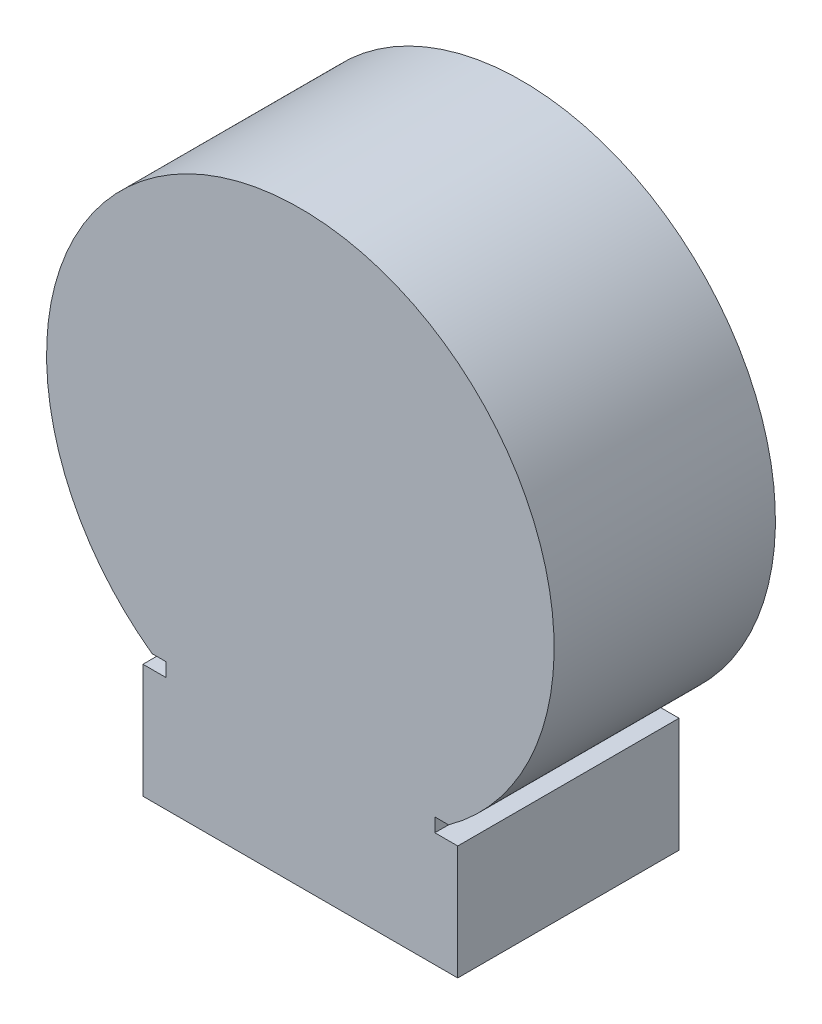
ISO-10303-21;
HEADER;
FILE_DESCRIPTION(('STEP AP214'),'2;1');
FILE_NAME('part.step','',(''),(''),'','','');
FILE_SCHEMA(('AUTOMOTIVE_DESIGN { 1 0 10303 214 1 1 1 1 }'));
ENDSEC;
DATA;
#1=APPLICATION_CONTEXT('core data for automotive mechanical design processes');
#2=APPLICATION_PROTOCOL_DEFINITION('international standard','automotive_design',2000,#1);
#3=PRODUCT_CONTEXT('',#1,'mechanical');
#4=PRODUCT('Part','Part','',(#3));
#5=PRODUCT_RELATED_PRODUCT_CATEGORY('part','',(#4));
#6=PRODUCT_DEFINITION_FORMATION('','',#4);
#7=PRODUCT_DEFINITION_CONTEXT('part definition',#1,'design');
#8=PRODUCT_DEFINITION('design','',#6,#7);
#9=PRODUCT_DEFINITION_SHAPE('','',#8);
#10=(LENGTH_UNIT() NAMED_UNIT(*) SI_UNIT(.MILLI.,.METRE.));
#11=(NAMED_UNIT(*) PLANE_ANGLE_UNIT() SI_UNIT($,.RADIAN.));
#12=(NAMED_UNIT(*) SI_UNIT($,.STERADIAN.) SOLID_ANGLE_UNIT());
#13=UNCERTAINTY_MEASURE_WITH_UNIT(LENGTH_MEASURE(1.E-05),#10,'distance_accuracy_value','');
#14=(GEOMETRIC_REPRESENTATION_CONTEXT(3) GLOBAL_UNCERTAINTY_ASSIGNED_CONTEXT((#13)) GLOBAL_UNIT_ASSIGNED_CONTEXT((#10,
#11,#12)) REPRESENTATION_CONTEXT('',''));
#15=CARTESIAN_POINT('',(0.,0.,0.));
#16=DIRECTION('',(0.,0.,1.));
#17=DIRECTION('',(1.,0.,0.));
#18=AXIS2_PLACEMENT_3D('',#15,#16,#17);
#19=CARTESIAN_POINT('',(8.73999999999999,3.175,12.29));
#20=DIRECTION('',(-1.,0.,0.));
#21=DIRECTION('',(0.,0.,1.));
#22=AXIS2_PLACEMENT_3D('',#19,#20,#21);
#23=PLANE('',#22);
#24=DIRECTION('',(0.,1.,0.));
#25=VECTOR('',#24,1.);
#26=CARTESIAN_POINT('',(8.73999999999999,3.175,0.));
#27=LINE('',#26,#25);
#28=CARTESIAN_POINT('',(8.73999999999999,-3.175,0.));
#29=VERTEX_POINT('',#28);
#30=CARTESIAN_POINT('',(8.73999999999999,3.175,0.));
#31=VERTEX_POINT('',#30);
#32=EDGE_CURVE('E140',#29,#31,#27,.T.);
#33=ORIENTED_EDGE('',*,*,#32,.T.);
#34=DIRECTION('',(0.,0.,-1.));
#35=VECTOR('',#34,1.);
#36=CARTESIAN_POINT('',(8.73999999999999,3.175,12.29));
#37=LINE('',#36,#35);
#38=CARTESIAN_POINT('',(8.73999999999999,3.175,12.29));
#39=VERTEX_POINT('',#38);
#40=EDGE_CURVE('E11',#39,#31,#37,.T.);
#41=ORIENTED_EDGE('',*,*,#40,.F.);
#42=DIRECTION('',(0.,1.,0.));
#43=VECTOR('',#42,1.);
#44=CARTESIAN_POINT('',(8.73999999999999,3.175,12.29));
#45=LINE('',#44,#43);
#46=CARTESIAN_POINT('',(8.73999999999999,-3.175,12.29));
#47=VERTEX_POINT('',#46);
#48=EDGE_CURVE('E158',#47,#39,#45,.T.);
#49=ORIENTED_EDGE('',*,*,#48,.F.);
#50=DIRECTION('',(0.,0.,-1.));
#51=VECTOR('',#50,1.);
#52=CARTESIAN_POINT('',(8.73999999999999,-3.175,12.29));
#53=LINE('',#52,#51);
#54=EDGE_CURVE('E136',#47,#29,#53,.T.);
#55=ORIENTED_EDGE('',*,*,#54,.T.);
#56=EDGE_LOOP('',(#33,#41,#49,#55));
#57=FACE_BOUND('',#56,.T.);
#58=ADVANCED_FACE('F32',(#57),#23,.F.);
#59=CARTESIAN_POINT('',(8.73999999999999,3.175,12.29));
#60=DIRECTION('',(0.,-1.,0.));
#61=DIRECTION('',(1.,0.,0.));
#62=AXIS2_PLACEMENT_3D('',#59,#60,#61);
#63=PLANE('',#62);
#64=DIRECTION('',(-1.,0.,0.));
#65=VECTOR('',#64,1.);
#66=CARTESIAN_POINT('',(8.73999999999999,3.175,0.));
#67=LINE('',#66,#65);
#68=CARTESIAN_POINT('',(7.46999999999999,3.175,0.));
#69=VERTEX_POINT('',#68);
#70=EDGE_CURVE('E143',#31,#69,#67,.T.);
#71=ORIENTED_EDGE('',*,*,#70,.T.);
#72=DIRECTION('',(0.,0.,-1.));
#73=VECTOR('',#72,1.);
#74=CARTESIAN_POINT('',(7.46999999999999,3.175,12.29));
#75=LINE('',#74,#73);
#76=CARTESIAN_POINT('',(7.46999999999999,3.175,12.29));
#77=VERTEX_POINT('',#76);
#78=EDGE_CURVE('E40',#77,#69,#75,.T.);
#79=ORIENTED_EDGE('',*,*,#78,.F.);
#80=DIRECTION('',(-1.,0.,0.));
#81=VECTOR('',#80,1.);
#82=CARTESIAN_POINT('',(8.73999999999999,3.175,12.29));
#83=LINE('',#82,#81);
#84=EDGE_CURVE('E97',#39,#77,#83,.T.);
#85=ORIENTED_EDGE('',*,*,#84,.F.);
#86=ORIENTED_EDGE('',*,*,#40,.T.);
#87=EDGE_LOOP('',(#71,#79,#85,#86));
#88=FACE_BOUND('',#87,.T.);
#89=ADVANCED_FACE('F207',(#88),#63,.F.);
#90=CARTESIAN_POINT('',(7.46999999999999,3.175,12.29));
#91=DIRECTION('',(-1.,0.,0.));
#92=DIRECTION('',(0.,0.,1.));
#93=AXIS2_PLACEMENT_3D('',#90,#91,#92);
#94=PLANE('',#93);
#95=DIRECTION('',(0.,1.,0.));
#96=VECTOR('',#95,1.);
#97=CARTESIAN_POINT('',(7.46999999999999,3.175,0.));
#98=LINE('',#97,#96);
#99=CARTESIAN_POINT('',(7.46999999999999,3.937,0.));
#100=VERTEX_POINT('',#99);
#101=EDGE_CURVE('E145',#69,#100,#98,.T.);
#102=ORIENTED_EDGE('',*,*,#101,.T.);
#103=DIRECTION('',(0.,0.,-1.));
#104=VECTOR('',#103,1.);
#105=CARTESIAN_POINT('',(7.46999999999999,3.937,12.29));
#106=LINE('',#105,#104);
#107=CARTESIAN_POINT('',(7.46999999999999,3.937,12.29));
#108=VERTEX_POINT('',#107);
#109=EDGE_CURVE('E171',#108,#100,#106,.T.);
#110=ORIENTED_EDGE('',*,*,#109,.F.);
#111=DIRECTION('',(0.,1.,0.));
#112=VECTOR('',#111,1.);
#113=CARTESIAN_POINT('',(7.46999999999999,3.175,12.29));
#114=LINE('',#113,#112);
#115=EDGE_CURVE('E179',#77,#108,#114,.T.);
#116=ORIENTED_EDGE('',*,*,#115,.F.);
#117=ORIENTED_EDGE('',*,*,#78,.T.);
#118=EDGE_LOOP('',(#102,#110,#116,#117));
#119=FACE_BOUND('',#118,.T.);
#120=ADVANCED_FACE('F177',(#119),#94,.F.);
#121=CARTESIAN_POINT('',(7.46999999999999,3.937,12.29));
#122=DIRECTION('',(0.,1.,0.));
#123=DIRECTION('',(0.,0.,1.));
#124=AXIS2_PLACEMENT_3D('',#121,#122,#123);
#125=PLANE('',#124);
#126=DIRECTION('',(1.,0.,0.));
#127=VECTOR('',#126,1.);
#128=CARTESIAN_POINT('',(7.46999999999999,3.937,0.));
#129=LINE('',#128,#127);
#130=CARTESIAN_POINT('',(8.23199999999998,3.93699999999999,0.));
#131=VERTEX_POINT('',#130);
#132=EDGE_CURVE('E147',#100,#131,#129,.T.);
#133=ORIENTED_EDGE('',*,*,#132,.T.);
#134=DIRECTION('',(0.,0.,-1.));
#135=VECTOR('',#134,1.);
#136=CARTESIAN_POINT('',(8.23199999999998,3.93699999999999,12.29));
#137=LINE('',#136,#135);
#138=CARTESIAN_POINT('',(8.23199999999998,3.93699999999999,12.29));
#139=VERTEX_POINT('',#138);
#140=EDGE_CURVE('E168',#139,#131,#137,.T.);
#141=ORIENTED_EDGE('',*,*,#140,.F.);
#142=DIRECTION('',(1.,0.,0.));
#143=VECTOR('',#142,1.);
#144=CARTESIAN_POINT('',(7.46999999999999,3.937,12.29));
#145=LINE('',#144,#143);
#146=EDGE_CURVE('E197',#108,#139,#145,.T.);
#147=ORIENTED_EDGE('',*,*,#146,.F.);
#148=ORIENTED_EDGE('',*,*,#109,.T.);
#149=EDGE_LOOP('',(#133,#141,#147,#148));
#150=FACE_BOUND('',#149,.T.);
#151=ADVANCED_FACE('F188',(#150),#125,.F.);
#152=CARTESIAN_POINT('',(0.,15.3766478272943,12.29));
#153=DIRECTION('',(0.,0.,-1.));
#154=DIRECTION('',(-1.,0.,0.));
#155=AXIS2_PLACEMENT_3D('',#152,#153,#154);
#156=CYLINDRICAL_SURFACE('',#155,14.0936640520668);
#157=CARTESIAN_POINT('',(0.,15.3766478272943,0.));
#158=DIRECTION('',(0.,0.,1.));
#159=DIRECTION('',(-1.,0.,0.));
#160=AXIS2_PLACEMENT_3D('',#157,#158,#159);
#161=CIRCLE('',#160,14.0936640520668);
#162=CARTESIAN_POINT('',(-8.232,3.937,0.));
#163=VERTEX_POINT('',#162);
#164=EDGE_CURVE('E149',#131,#163,#161,.T.);
#165=ORIENTED_EDGE('',*,*,#164,.T.);
#166=DIRECTION('',(0.,0.,-1.));
#167=VECTOR('',#166,1.);
#168=CARTESIAN_POINT('',(-8.232,3.937,12.29));
#169=LINE('',#168,#167);
#170=CARTESIAN_POINT('',(-8.232,3.937,12.29));
#171=VERTEX_POINT('',#170);
#172=EDGE_CURVE('E165',#171,#163,#169,.T.);
#173=ORIENTED_EDGE('',*,*,#172,.F.);
#174=CARTESIAN_POINT('',(0.,15.3766478272943,12.29));
#175=DIRECTION('',(0.,0.,1.));
#176=DIRECTION('',(-1.,0.,0.));
#177=AXIS2_PLACEMENT_3D('',#174,#175,#176);
#178=CIRCLE('',#177,14.0936640520668);
#179=EDGE_CURVE('E194',#139,#171,#178,.T.);
#180=ORIENTED_EDGE('',*,*,#179,.F.);
#181=ORIENTED_EDGE('',*,*,#140,.T.);
#182=EDGE_LOOP('',(#165,#173,#180,#181));
#183=FACE_BOUND('',#182,.T.);
#184=ADVANCED_FACE('F192',(#183),#156,.T.);
#185=CARTESIAN_POINT('',(-7.47,3.937,12.29));
#186=DIRECTION('',(0.,1.,0.));
#187=DIRECTION('',(0.,0.,1.));
#188=AXIS2_PLACEMENT_3D('',#185,#186,#187);
#189=PLANE('',#188);
#190=DIRECTION('',(1.,0.,0.));
#191=VECTOR('',#190,1.);
#192=CARTESIAN_POINT('',(-7.47,3.937,0.));
#193=LINE('',#192,#191);
#194=CARTESIAN_POINT('',(-7.47,3.937,0.));
#195=VERTEX_POINT('',#194);
#196=EDGE_CURVE('E151',#163,#195,#193,.T.);
#197=ORIENTED_EDGE('',*,*,#196,.T.);
#198=DIRECTION('',(0.,0.,-1.));
#199=VECTOR('',#198,1.);
#200=CARTESIAN_POINT('',(-7.47,3.937,12.29));
#201=LINE('',#200,#199);
#202=CARTESIAN_POINT('',(-7.47,3.937,12.29));
#203=VERTEX_POINT('',#202);
#204=EDGE_CURVE('E162',#203,#195,#201,.T.);
#205=ORIENTED_EDGE('',*,*,#204,.F.);
#206=DIRECTION('',(1.,0.,0.));
#207=VECTOR('',#206,1.);
#208=CARTESIAN_POINT('',(-7.47,3.937,12.29));
#209=LINE('',#208,#207);
#210=EDGE_CURVE('E196',#171,#203,#209,.T.);
#211=ORIENTED_EDGE('',*,*,#210,.F.);
#212=ORIENTED_EDGE('',*,*,#172,.T.);
#213=EDGE_LOOP('',(#197,#205,#211,#212));
#214=FACE_BOUND('',#213,.T.);
#215=ADVANCED_FACE('F219',(#214),#189,.F.);
#216=CARTESIAN_POINT('',(-7.47,3.175,12.29));
#217=DIRECTION('',(1.,0.,0.));
#218=DIRECTION('',(0.,0.,-1.));
#219=AXIS2_PLACEMENT_3D('',#216,#217,#218);
#220=PLANE('',#219);
#221=DIRECTION('',(0.,-1.,0.));
#222=VECTOR('',#221,1.);
#223=CARTESIAN_POINT('',(-7.47,3.175,0.));
#224=LINE('',#223,#222);
#225=CARTESIAN_POINT('',(-7.47,3.175,0.));
#226=VERTEX_POINT('',#225);
#227=EDGE_CURVE('E153',#195,#226,#224,.T.);
#228=ORIENTED_EDGE('',*,*,#227,.T.);
#229=DIRECTION('',(0.,0.,-1.));
#230=VECTOR('',#229,1.);
#231=CARTESIAN_POINT('',(-7.47,3.175,12.29));
#232=LINE('',#231,#230);
#233=CARTESIAN_POINT('',(-7.47,3.175,12.29));
#234=VERTEX_POINT('',#233);
#235=EDGE_CURVE('E131',#234,#226,#232,.T.);
#236=ORIENTED_EDGE('',*,*,#235,.F.);
#237=DIRECTION('',(0.,-1.,0.));
#238=VECTOR('',#237,1.);
#239=CARTESIAN_POINT('',(-7.47,3.175,12.29));
#240=LINE('',#239,#238);
#241=EDGE_CURVE('E122',#203,#234,#240,.T.);
#242=ORIENTED_EDGE('',*,*,#241,.F.);
#243=ORIENTED_EDGE('',*,*,#204,.T.);
#244=EDGE_LOOP('',(#228,#236,#242,#243));
#245=FACE_BOUND('',#244,.T.);
#246=ADVANCED_FACE('F222',(#245),#220,.F.);
#247=CARTESIAN_POINT('',(-8.74,3.175,12.29));
#248=DIRECTION('',(0.,-1.,0.));
#249=DIRECTION('',(1.,0.,0.));
#250=AXIS2_PLACEMENT_3D('',#247,#248,#249);
#251=PLANE('',#250);
#252=DIRECTION('',(-1.,0.,0.));
#253=VECTOR('',#252,1.);
#254=CARTESIAN_POINT('',(-8.74,3.175,0.));
#255=LINE('',#254,#253);
#256=CARTESIAN_POINT('',(-8.74,3.175,0.));
#257=VERTEX_POINT('',#256);
#258=EDGE_CURVE('E130',#226,#257,#255,.T.);
#259=ORIENTED_EDGE('',*,*,#258,.T.);
#260=DIRECTION('',(0.,0.,-1.));
#261=VECTOR('',#260,1.);
#262=CARTESIAN_POINT('',(-8.74,3.175,12.29));
#263=LINE('',#262,#261);
#264=CARTESIAN_POINT('',(-8.74,3.175,12.29));
#265=VERTEX_POINT('',#264);
#266=EDGE_CURVE('E127',#265,#257,#263,.T.);
#267=ORIENTED_EDGE('',*,*,#266,.F.);
#268=DIRECTION('',(-1.,0.,0.));
#269=VECTOR('',#268,1.);
#270=CARTESIAN_POINT('',(-8.74,3.175,12.29));
#271=LINE('',#270,#269);
#272=EDGE_CURVE('E116',#234,#265,#271,.T.);
#273=ORIENTED_EDGE('',*,*,#272,.F.);
#274=ORIENTED_EDGE('',*,*,#235,.T.);
#275=EDGE_LOOP('',(#259,#267,#273,#274));
#276=FACE_BOUND('',#275,.T.);
#277=ADVANCED_FACE('F128',(#276),#251,.F.);
#278=CARTESIAN_POINT('',(-8.74,3.175,12.29));
#279=DIRECTION('',(1.,0.,0.));
#280=DIRECTION('',(0.,0.,-1.));
#281=AXIS2_PLACEMENT_3D('',#278,#279,#280);
#282=PLANE('',#281);
#283=DIRECTION('',(0.,-1.,0.));
#284=VECTOR('',#283,1.);
#285=CARTESIAN_POINT('',(-8.74,3.175,0.));
#286=LINE('',#285,#284);
#287=CARTESIAN_POINT('',(-8.74,-3.175,0.));
#288=VERTEX_POINT('',#287);
#289=EDGE_CURVE('E83',#257,#288,#286,.T.);
#290=ORIENTED_EDGE('',*,*,#289,.T.);
#291=DIRECTION('',(0.,0.,-1.));
#292=VECTOR('',#291,1.);
#293=CARTESIAN_POINT('',(-8.74,-3.175,12.29));
#294=LINE('',#293,#292);
#295=CARTESIAN_POINT('',(-8.74,-3.175,12.29));
#296=VERTEX_POINT('',#295);
#297=EDGE_CURVE('E132',#296,#288,#294,.T.);
#298=ORIENTED_EDGE('',*,*,#297,.F.);
#299=DIRECTION('',(0.,-1.,0.));
#300=VECTOR('',#299,1.);
#301=CARTESIAN_POINT('',(-8.74,3.175,12.29));
#302=LINE('',#301,#300);
#303=EDGE_CURVE('E120',#265,#296,#302,.T.);
#304=ORIENTED_EDGE('',*,*,#303,.F.);
#305=ORIENTED_EDGE('',*,*,#266,.T.);
#306=EDGE_LOOP('',(#290,#298,#304,#305));
#307=FACE_BOUND('',#306,.T.);
#308=ADVANCED_FACE('F134',(#307),#282,.F.);
#309=CARTESIAN_POINT('',(-8.74,-3.175,12.29));
#310=DIRECTION('',(0.,1.,0.));
#311=DIRECTION('',(0.,0.,1.));
#312=AXIS2_PLACEMENT_3D('',#309,#310,#311);
#313=PLANE('',#312);
#314=DIRECTION('',(1.,0.,0.));
#315=VECTOR('',#314,1.);
#316=CARTESIAN_POINT('',(-8.74,-3.175,0.));
#317=LINE('',#316,#315);
#318=EDGE_CURVE('E89',#288,#29,#317,.T.);
#319=ORIENTED_EDGE('',*,*,#318,.T.);
#320=ORIENTED_EDGE('',*,*,#54,.F.);
#321=DIRECTION('',(1.,0.,0.));
#322=VECTOR('',#321,1.);
#323=CARTESIAN_POINT('',(-8.74,-3.175,12.29));
#324=LINE('',#323,#322);
#325=EDGE_CURVE('E48',#296,#47,#324,.T.);
#326=ORIENTED_EDGE('',*,*,#325,.F.);
#327=ORIENTED_EDGE('',*,*,#297,.T.);
#328=EDGE_LOOP('',(#319,#320,#326,#327));
#329=FACE_BOUND('',#328,.T.);
#330=ADVANCED_FACE('F231',(#329),#313,.F.);
#331=CARTESIAN_POINT('',(0.,15.3766478272943,12.29));
#332=DIRECTION('',(0.,0.,-1.));
#333=DIRECTION('',(-1.,0.,0.));
#334=AXIS2_PLACEMENT_3D('',#331,#332,#333);
#335=PLANE('',#334);
#336=ORIENTED_EDGE('',*,*,#48,.T.);
#337=ORIENTED_EDGE('',*,*,#84,.T.);
#338=ORIENTED_EDGE('',*,*,#115,.T.);
#339=ORIENTED_EDGE('',*,*,#146,.T.);
#340=ORIENTED_EDGE('',*,*,#179,.T.);
#341=ORIENTED_EDGE('',*,*,#210,.T.);
#342=ORIENTED_EDGE('',*,*,#241,.T.);
#343=ORIENTED_EDGE('',*,*,#272,.T.);
#344=ORIENTED_EDGE('',*,*,#303,.T.);
#345=ORIENTED_EDGE('',*,*,#325,.T.);
#346=EDGE_LOOP('',(#336,#337,#338,#339,#340,#341,#342,#343,#344,#345));
#347=FACE_BOUND('',#346,.T.);
#348=ADVANCED_FACE('F118',(#347),#335,.F.);
#349=CARTESIAN_POINT('',(0.,15.3766478272943,0.));
#350=DIRECTION('',(0.,0.,-1.));
#351=DIRECTION('',(-1.,0.,0.));
#352=AXIS2_PLACEMENT_3D('',#349,#350,#351);
#353=PLANE('',#352);
#354=ORIENTED_EDGE('',*,*,#32,.F.);
#355=ORIENTED_EDGE('',*,*,#318,.F.);
#356=ORIENTED_EDGE('',*,*,#289,.F.);
#357=ORIENTED_EDGE('',*,*,#258,.F.);
#358=ORIENTED_EDGE('',*,*,#227,.F.);
#359=ORIENTED_EDGE('',*,*,#196,.F.);
#360=ORIENTED_EDGE('',*,*,#164,.F.);
#361=ORIENTED_EDGE('',*,*,#132,.F.);
#362=ORIENTED_EDGE('',*,*,#101,.F.);
#363=ORIENTED_EDGE('',*,*,#70,.F.);
#364=EDGE_LOOP('',(#354,#355,#356,#357,#358,#359,#360,#361,#362,#363));
#365=FACE_BOUND('',#364,.T.);
#366=ADVANCED_FACE('F183',(#365),#353,.T.);
#367=CLOSED_SHELL('',(#58,#89,#120,#151,#184,#215,#246,#277,#308,#330,#348,#366));
#368=MANIFOLD_SOLID_BREP('B2',#367);
#369=ADVANCED_BREP_SHAPE_REPRESENTATION('',(#18,#368),#14);
#370=SHAPE_DEFINITION_REPRESENTATION(#9,#369);
ENDSEC;
END-ISO-10303-21;
